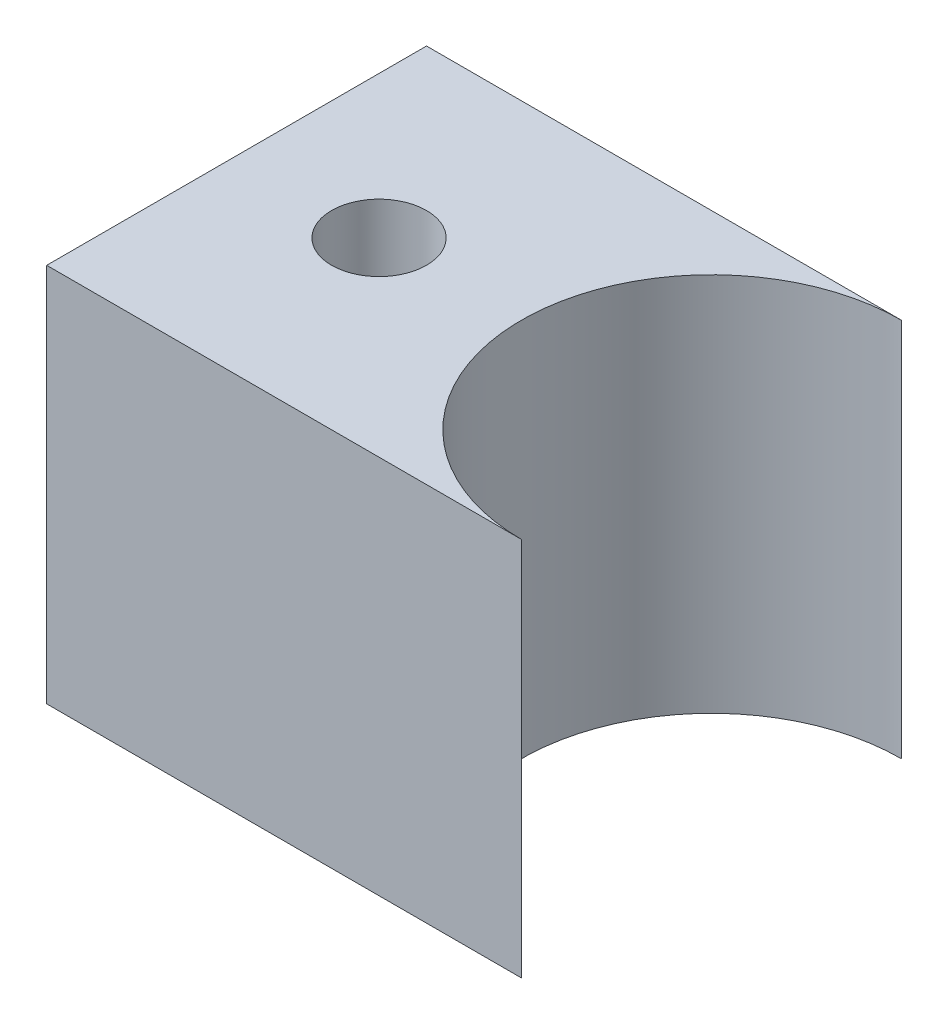
ISO-10303-21;
HEADER;
FILE_DESCRIPTION(('STEP AP214'),'2;1');
FILE_NAME('part.step','',(''),(''),'','','');
FILE_SCHEMA(('AUTOMOTIVE_DESIGN { 1 0 10303 214 1 1 1 1 }'));
ENDSEC;
DATA;
#1=APPLICATION_CONTEXT('core data for automotive mechanical design processes');
#2=APPLICATION_PROTOCOL_DEFINITION('international standard','automotive_design',2000,#1);
#3=PRODUCT_CONTEXT('',#1,'mechanical');
#4=PRODUCT('Part','Part','',(#3));
#5=PRODUCT_RELATED_PRODUCT_CATEGORY('part','',(#4));
#6=PRODUCT_DEFINITION_FORMATION('','',#4);
#7=PRODUCT_DEFINITION_CONTEXT('part definition',#1,'design');
#8=PRODUCT_DEFINITION('design','',#6,#7);
#9=PRODUCT_DEFINITION_SHAPE('','',#8);
#10=(LENGTH_UNIT() NAMED_UNIT(*) SI_UNIT(.MILLI.,.METRE.));
#11=(NAMED_UNIT(*) PLANE_ANGLE_UNIT() SI_UNIT($,.RADIAN.));
#12=(NAMED_UNIT(*) SI_UNIT($,.STERADIAN.) SOLID_ANGLE_UNIT());
#13=UNCERTAINTY_MEASURE_WITH_UNIT(LENGTH_MEASURE(1.E-05),#10,'distance_accuracy_value','');
#14=(GEOMETRIC_REPRESENTATION_CONTEXT(3) GLOBAL_UNCERTAINTY_ASSIGNED_CONTEXT((#13)) GLOBAL_UNIT_ASSIGNED_CONTEXT((#10,
#11,#12)) REPRESENTATION_CONTEXT('',''));
#15=CARTESIAN_POINT('',(0.,0.,0.));
#16=DIRECTION('',(0.,0.,1.));
#17=DIRECTION('',(1.,0.,0.));
#18=AXIS2_PLACEMENT_3D('',#15,#16,#17);
#19=CARTESIAN_POINT('',(-6.35,25.4,0.));
#20=DIRECTION('',(0.,-1.,0.));
#21=DIRECTION('',(0.,0.,-1.));
#22=AXIS2_PLACEMENT_3D('',#19,#20,#21);
#23=CYLINDRICAL_SURFACE('',#22,3.175);
#24=CARTESIAN_POINT('',(-6.35,16.2497579142809,-3.175));
#25=CARTESIAN_POINT('',(-6.42753031308926,16.2497496400657,-3.17500484576827));
#26=CARTESIAN_POINT('',(-6.50502629434486,16.2523079473555,-3.1721556587343));
#27=CARTESIAN_POINT('',(-6.65929000651205,16.2623750839429,-3.16084602870887));
#28=CARTESIAN_POINT('',(-6.73605761931208,16.2698847026793,-3.15238469091285));
#29=CARTESIAN_POINT('',(-6.96442289011765,16.2993888201432,-3.11877225231689));
#30=CARTESIAN_POINT('',(-7.11399762373616,16.3283579924054,-3.0853929885701));
#31=CARTESIAN_POINT('',(-7.40212661781048,16.399768221941,-2.99935785351024));
#32=CARTESIAN_POINT('',(-7.54077248347449,16.442077978454,-2.94688912119207));
#33=CARTESIAN_POINT('',(-7.80710374222936,16.5351493184864,-2.82470091022495));
#34=CARTESIAN_POINT('',(-7.93478685167322,16.5859126565251,-2.7549778490209));
#35=CARTESIAN_POINT('',(-8.19728822286527,16.6996413858596,-2.58766885557099));
#36=CARTESIAN_POINT('',(-8.33012347446768,16.7632761621358,-2.48743519963699));
#37=CARTESIAN_POINT('',(-8.57887057951206,16.890132586964,-2.26723292903927));
#38=CARTESIAN_POINT('',(-8.69476574887365,16.9533537704254,-2.14724510270102));
#39=CARTESIAN_POINT('',(-8.86195425151352,17.0483568223087,-1.94419368751008));
#40=CARTESIAN_POINT('',(-8.91969979024176,17.082035089254,-1.86724400494194));
#41=CARTESIAN_POINT('',(-9.028414283062,17.1466582642628,-1.70764042398512));
#42=CARTESIAN_POINT('',(-9.07938635617953,17.1776044281781,-1.62498917785726));
#43=CARTESIAN_POINT('',(-9.17396661882382,17.2358773773803,-1.45442160053206));
#44=CARTESIAN_POINT('',(-9.21757884139952,17.2632061431457,-1.36650818891102));
#45=CARTESIAN_POINT('',(-9.29683992359477,17.3134267129244,-1.18594835879345));
#46=CARTESIAN_POINT('',(-9.33249048897753,17.3363194672015,-1.09330295934871));
#47=CARTESIAN_POINT('',(-9.39168737104099,17.3746330315689,-0.914657611479679));
#48=CARTESIAN_POINT('',(-9.41614243894167,17.3906036897988,-0.829076462973849));
#49=CARTESIAN_POINT('',(-9.4578834845324,17.4179945641402,-0.655478654592643));
#50=CARTESIAN_POINT('',(-9.47517086623115,17.429415671402,-0.567462475298446));
#51=CARTESIAN_POINT('',(-9.50225014551956,17.4473527428168,-0.389870000382388));
#52=CARTESIAN_POINT('',(-9.51204941028754,17.4538735280429,-0.300295327079504));
#53=CARTESIAN_POINT('',(-9.52399644038159,17.4618293897958,-0.120445655332521));
#54=CARTESIAN_POINT('',(-9.52614528529924,17.4632651838927,-0.03017075750285));
#55=CARTESIAN_POINT('',(-9.52153058764431,17.4601842967821,0.212847482025028));
#56=CARTESIAN_POINT('',(-9.50754934882403,17.4508467119292,0.365477283401844));
#57=CARTESIAN_POINT('',(-9.45818598858135,17.4181851456931,0.665571061923041));
#58=CARTESIAN_POINT('',(-9.42280230640607,17.3948601442918,0.813034661497298));
#59=CARTESIAN_POINT('',(-9.3326003760419,17.3363255583869,1.09866580308969));
#60=CARTESIAN_POINT('',(-9.27785937303013,17.30116323696,1.2368677334448));
#61=CARTESIAN_POINT('',(-9.15105898860202,17.2215354096447,1.50210915896256));
#62=CARTESIAN_POINT('',(-9.07899644590943,17.1770682057561,1.62914661076028));
#63=CARTESIAN_POINT('',(-8.90908362709179,17.0754365573515,1.88640062998471));
#64=CARTESIAN_POINT('',(-8.80908902241075,17.0173714570948,2.01484129193776));
#65=CARTESIAN_POINT('',(-8.59171088064502,16.8973595865327,2.2542312534673));
#66=CARTESIAN_POINT('',(-8.47430052063018,16.8354069152307,2.36515301728573));
#67=CARTESIAN_POINT('',(-8.2042583924647,16.7028819527573,2.58400917496166));
#68=CARTESIAN_POINT('',(-8.04898840795544,16.6324648272995,2.688805774772));
#69=CARTESIAN_POINT('',(-7.71920313322987,16.5016753247811,2.87075365584123));
#70=CARTESIAN_POINT('',(-7.54472075954532,16.4412861987618,2.94795128728295));
#71=CARTESIAN_POINT('',(-7.23150848847472,16.3554230656605,3.0532819999139));
#72=CARTESIAN_POINT('',(-7.0967705249033,16.3249032875381,3.08912881829449));
#73=CARTESIAN_POINT('',(-6.82142481004695,16.2783685067922,3.1429254455291));
#74=CARTESIAN_POINT('',(-6.68082767980521,16.2623283589883,3.16090628575237));
#75=CARTESIAN_POINT('',(-6.3969217589822,16.2472299671058,3.17784797716998));
#76=CARTESIAN_POINT('',(-6.25360385906356,16.2482455999881,3.17672608475743));
#77=CARTESIAN_POINT('',(-5.96950191363213,16.2672693509993,3.15534087182034));
#78=CARTESIAN_POINT('',(-5.82872001633065,16.2852912431756,3.13506203530837));
#79=CARTESIAN_POINT('',(-5.56039429952431,16.3342316423522,3.07815950249654));
#80=CARTESIAN_POINT('',(-5.43253976157802,16.3644768430135,3.04238302035307));
#81=CARTESIAN_POINT('',(-5.18457459989573,16.4342755899854,2.95629078554842));
#82=CARTESIAN_POINT('',(-5.06446659344277,16.4738322615455,2.90597015007478));
#83=CARTESIAN_POINT('',(-4.80980431903229,16.5673323026917,2.78071812737818));
#84=CARTESIAN_POINT('',(-4.67716106171379,16.6225709179322,2.70287795751937));
#85=CARTESIAN_POINT('',(-4.42528832580718,16.7364174223926,2.52972461255558));
#86=CARTESIAN_POINT('',(-4.30607546716036,16.7950293534948,2.43439016364708));
#87=CARTESIAN_POINT('',(-4.05770977340867,16.9239513934039,2.20466694119547));
#88=CARTESIAN_POINT('',(-3.932074228409,16.9940200527151,2.06629613591577));
#89=CARTESIAN_POINT('',(-3.70551601582908,17.1255623617207,1.76704543824848));
#90=CARTESIAN_POINT('',(-3.60457151313051,17.1870435847794,1.60618563296259));
#91=CARTESIAN_POINT('',(-3.44822186446787,17.2845542872229,1.29776136627992));
#92=CARTESIAN_POINT('',(-3.38779404919719,17.3232041475117,1.15357650425641));
#93=CARTESIAN_POINT('',(-3.28833607902003,17.3875494873898,0.85527686294568));
#94=CARTESIAN_POINT('',(-3.24928785172457,17.4132559067226,0.70117059387859));
#95=CARTESIAN_POINT('',(-3.19453106989147,17.4494565289199,0.386348910278897));
#96=CARTESIAN_POINT('',(-3.17892639622874,17.4598830198291,0.225607303606698));
#97=CARTESIAN_POINT('',(-3.17238403592976,17.4642434088546,-0.0966081801862686));
#98=CARTESIAN_POINT('',(-3.1814440564727,17.4581788399738,-0.25808198784882));
#99=CARTESIAN_POINT('',(-3.2220844386066,17.4312192010763,-0.564765082925264));
#100=CARTESIAN_POINT('',(-3.25197943778886,17.4114345254766,-0.710303289757514));
#101=CARTESIAN_POINT('',(-3.33095284065091,17.359885686265,-0.993804246374777));
#102=CARTESIAN_POINT('',(-3.38003422439303,17.3281196617162,-1.13176581554505));
#103=CARTESIAN_POINT('',(-3.4987526913278,17.2528192761879,-1.40517133388982));
#104=CARTESIAN_POINT('',(-3.56941485289669,17.2087103235538,-1.54000769986339));
#105=CARTESIAN_POINT('',(-3.72768915860166,17.1128596092095,-1.79633985000039));
#106=CARTESIAN_POINT('',(-3.81531144498894,17.0611132847267,-1.917827583115));
#107=CARTESIAN_POINT('',(-4.02054833805973,16.9448627720992,-2.16422958614353));
#108=CARTESIAN_POINT('',(-4.14071262225813,16.8796320726258,-2.28667757230637));
#109=CARTESIAN_POINT('',(-4.39914292516088,16.7489721129079,-2.51079031886472));
#110=CARTESIAN_POINT('',(-4.53742235990132,16.6835427409576,-2.61243953137712));
#111=CARTESIAN_POINT('',(-4.81943918366087,16.5637241820613,-2.78627302038784));
#112=CARTESIAN_POINT('',(-4.96195415261561,16.5088735005282,-2.86011420444801));
#113=CARTESIAN_POINT('',(-5.25984127911376,16.4107423377871,-2.98633792804776));
#114=CARTESIAN_POINT('',(-5.41518774393146,16.3674394361282,-3.03876215630908));
#115=CARTESIAN_POINT('',(-5.7003432907101,16.3066557783442,-3.11048942328417));
#116=CARTESIAN_POINT('',(-5.82818035101134,16.2855788973276,-3.13455833161691));
#117=CARTESIAN_POINT('',(-6.08737974295221,16.2571426288587,-3.16680296090891));
#118=CARTESIAN_POINT('',(-6.21873907484623,16.2497719227519,-3.17499179598275));
#119=CARTESIAN_POINT('',(-6.35,16.2497579142809,-3.175));
#120=B_SPLINE_CURVE_WITH_KNOTS('',3,(#24,#25,#26,#27,#28,#29,#30,#31,#32,#33,#34,#35,#36,#37,
#38,#39,#40,#41,#42,#43,#44,#45,#46,#47,#48,#49,#50,#51,#52,#53,#54,#55,#56,#57,#58,#59,#60,#61,
#62,#63,#64,#65,#66,#67,#68,#69,#70,#71,#72,#73,#74,#75,#76,#77,#78,#79,#80,#81,#82,#83,#84,#85,
#86,#87,#88,#89,#90,#91,#92,#93,#94,#95,#96,#97,#98,#99,#100,#101,#102,#103,#104,#105,#106,#107,
#108,#109,#110,#111,#112,#113,#114,#115,#116,#117,#118,#119),.UNSPECIFIED.,.T.,.F.,(4,2,2,2,2,2,
2,2,2,2,2,2,2,2,2,2,2,2,2,2,2,2,2,2,2,2,2,2,2,2,2,2,2,2,2,2,2,2,2,2,2,2,2,2,2,2,2,4),(0.,
0.23243124625734,0.464899560397763,0.930088037462965,1.39083389168218,1.85167549198281,
2.38425030634412,2.917346163045,3.22278328993201,3.52807927902229,3.83320742500146,
4.1382701352628,4.40914536226321,4.6799675050406,4.95052285537199,5.2210400246797,
5.67924012217537,6.13747363750744,6.59389883732737,7.05040740058809,7.56690447915579,
8.0842054646496,8.68182442289395,9.27843496193814,9.70492668987399,10.1306763437413,
10.5582706022568,10.9862114839362,11.3932386756601,11.8004026749734,12.2889502819408,
12.7780959690837,13.37409312163,13.9695612926994,14.4506704720704,14.9313723344642,
15.4141980194601,15.8969788226923,16.3446564230742,16.7924035851585,17.2660585797609,
17.7399977027657,18.2884775296264,18.8373658802551,19.3443542518826,19.8503509991662,
20.2441887886898,20.6377011995485),.UNSPECIFIED.);
#121=CARTESIAN_POINT('',(-6.35,16.2497579142809,-3.175));
#122=VERTEX_POINT('',#121);
#123=EDGE_CURVE('E43',#122,#122,#120,.T.);
#124=ORIENTED_EDGE('',*,*,#123,.F.);
#125=EDGE_LOOP('',(#124));
#126=FACE_BOUND('',#125,.T.);
#127=CARTESIAN_POINT('',(-6.35,25.4,0.));
#128=DIRECTION('',(0.,1.,0.));
#129=DIRECTION('',(0.,0.,1.));
#130=AXIS2_PLACEMENT_3D('',#127,#128,#129);
#131=CIRCLE('',#130,3.175);
#132=CARTESIAN_POINT('',(-6.35,25.4,3.175));
#133=VERTEX_POINT('',#132);
#134=EDGE_CURVE('E121',#133,#133,#131,.T.);
#135=ORIENTED_EDGE('',*,*,#134,.T.);
#136=EDGE_LOOP('',(#135));
#137=FACE_BOUND('',#136,.T.);
#138=ADVANCED_FACE('F38',(#126,#137),#23,.F.);
#139=CARTESIAN_POINT('',(15.875,25.4,0.));
#140=DIRECTION('',(0.,-1.,0.));
#141=DIRECTION('',(0.,0.,-1.));
#142=AXIS2_PLACEMENT_3D('',#139,#140,#141);
#143=CYLINDRICAL_SURFACE('',#142,12.7);
#144=CARTESIAN_POINT('',(15.875,0.,0.));
#145=DIRECTION('',(0.,1.,0.));
#146=DIRECTION('',(0.,0.,1.));
#147=AXIS2_PLACEMENT_3D('',#144,#145,#146);
#148=CIRCLE('',#147,12.7);
#149=CARTESIAN_POINT('',(15.875,0.,-12.7));
#150=VERTEX_POINT('',#149);
#151=CARTESIAN_POINT('',(15.875,0.,12.7));
#152=VERTEX_POINT('',#151);
#153=EDGE_CURVE('E113',#150,#152,#148,.T.);
#154=ORIENTED_EDGE('',*,*,#153,.F.);
#155=DIRECTION('',(0.,-1.,0.));
#156=VECTOR('',#155,1.);
#157=CARTESIAN_POINT('',(15.875,25.4,-12.7));
#158=LINE('',#157,#156);
#159=CARTESIAN_POINT('',(15.875,25.4,-12.7));
#160=VERTEX_POINT('',#159);
#161=EDGE_CURVE('E11',#160,#150,#158,.T.);
#162=ORIENTED_EDGE('',*,*,#161,.F.);
#163=CARTESIAN_POINT('',(15.875,25.4,0.));
#164=DIRECTION('',(0.,1.,0.));
#165=DIRECTION('',(0.,0.,1.));
#166=AXIS2_PLACEMENT_3D('',#163,#164,#165);
#167=CIRCLE('',#166,12.7);
#168=CARTESIAN_POINT('',(15.875,25.4,12.7));
#169=VERTEX_POINT('',#168);
#170=EDGE_CURVE('E103',#160,#169,#167,.T.);
#171=ORIENTED_EDGE('',*,*,#170,.T.);
#172=DIRECTION('',(0.,-1.,0.));
#173=VECTOR('',#172,1.);
#174=CARTESIAN_POINT('',(15.875,25.4,12.7));
#175=LINE('',#174,#173);
#176=EDGE_CURVE('E84',#169,#152,#175,.T.);
#177=ORIENTED_EDGE('',*,*,#176,.T.);
#178=EDGE_LOOP('',(#154,#162,#171,#177));
#179=FACE_BOUND('',#178,.T.);
#180=ADVANCED_FACE('F151',(#179),#143,.F.);
#181=CARTESIAN_POINT('',(0.,25.4,-12.7));
#182=DIRECTION('',(0.,0.,-1.));
#183=DIRECTION('',(-1.,0.,0.));
#184=AXIS2_PLACEMENT_3D('',#181,#182,#183);
#185=PLANE('',#184);
#186=DIRECTION('',(1.,0.,0.));
#187=VECTOR('',#186,1.);
#188=CARTESIAN_POINT('',(0.,0.,-12.7));
#189=LINE('',#188,#187);
#190=CARTESIAN_POINT('',(-15.875,0.,-12.7));
#191=VERTEX_POINT('',#190);
#192=EDGE_CURVE('E95',#191,#150,#189,.T.);
#193=ORIENTED_EDGE('',*,*,#192,.F.);
#194=DIRECTION('',(0.,-1.,0.));
#195=VECTOR('',#194,1.);
#196=CARTESIAN_POINT('',(-15.875,25.4,-12.7));
#197=LINE('',#196,#195);
#198=CARTESIAN_POINT('',(-15.875,25.4,-12.7));
#199=VERTEX_POINT('',#198);
#200=EDGE_CURVE('E53',#199,#191,#197,.T.);
#201=ORIENTED_EDGE('',*,*,#200,.F.);
#202=DIRECTION('',(1.,0.,0.));
#203=VECTOR('',#202,1.);
#204=CARTESIAN_POINT('',(0.,25.4,-12.7));
#205=LINE('',#204,#203);
#206=EDGE_CURVE('E93',#199,#160,#205,.T.);
#207=ORIENTED_EDGE('',*,*,#206,.T.);
#208=ORIENTED_EDGE('',*,*,#161,.T.);
#209=EDGE_LOOP('',(#193,#201,#207,#208));
#210=FACE_BOUND('',#209,.T.);
#211=ADVANCED_FACE('F92',(#210),#185,.T.);
#212=CARTESIAN_POINT('',(-15.875,25.4,0.));
#213=DIRECTION('',(-1.,0.,0.));
#214=DIRECTION('',(0.,0.,1.));
#215=AXIS2_PLACEMENT_3D('',#212,#213,#214);
#216=PLANE('',#215);
#217=CARTESIAN_POINT('',(-15.875,12.7,0.));
#218=DIRECTION('',(-1.,0.,0.));
#219=DIRECTION('',(0.,0.,1.));
#220=AXIS2_PLACEMENT_3D('',#217,#218,#219);
#221=CIRCLE('',#220,4.7625);
#222=CARTESIAN_POINT('',(-15.875,12.7,4.7625));
#223=VERTEX_POINT('',#222);
#224=EDGE_CURVE('E161',#223,#223,#221,.T.);
#225=ORIENTED_EDGE('',*,*,#224,.F.);
#226=EDGE_LOOP('',(#225));
#227=FACE_BOUND('',#226,.T.);
#228=DIRECTION('',(0.,0.,-1.));
#229=VECTOR('',#228,1.);
#230=CARTESIAN_POINT('',(-15.875,0.,0.));
#231=LINE('',#230,#229);
#232=CARTESIAN_POINT('',(-15.875,0.,12.7));
#233=VERTEX_POINT('',#232);
#234=EDGE_CURVE('E117',#233,#191,#231,.T.);
#235=ORIENTED_EDGE('',*,*,#234,.F.);
#236=DIRECTION('',(0.,-1.,0.));
#237=VECTOR('',#236,1.);
#238=CARTESIAN_POINT('',(-15.875,25.4,12.7));
#239=LINE('',#238,#237);
#240=CARTESIAN_POINT('',(-15.875,25.4,12.7));
#241=VERTEX_POINT('',#240);
#242=EDGE_CURVE('E77',#241,#233,#239,.T.);
#243=ORIENTED_EDGE('',*,*,#242,.F.);
#244=DIRECTION('',(0.,0.,-1.));
#245=VECTOR('',#244,1.);
#246=CARTESIAN_POINT('',(-15.875,25.4,0.));
#247=LINE('',#246,#245);
#248=EDGE_CURVE('E102',#241,#199,#247,.T.);
#249=ORIENTED_EDGE('',*,*,#248,.T.);
#250=ORIENTED_EDGE('',*,*,#200,.T.);
#251=EDGE_LOOP('',(#235,#243,#249,#250));
#252=FACE_BOUND('',#251,.T.);
#253=ADVANCED_FACE('F105',(#227,#252),#216,.T.);
#254=CARTESIAN_POINT('',(-6.35,9.15024208571908,-3.175));
#255=CARTESIAN_POINT('',(-6.27246968691074,9.15025035993428,-3.17500484576827));
#256=CARTESIAN_POINT('',(-6.19497370565514,9.14769205264453,-3.1721556587343));
#257=CARTESIAN_POINT('',(-6.04070999348795,9.13762491605714,-3.16084602870887));
#258=CARTESIAN_POINT('',(-5.96394238068792,9.13011529732068,-3.15238469091285));
#259=CARTESIAN_POINT('',(-5.73557710988235,9.10061117985676,-3.11877225231689));
#260=CARTESIAN_POINT('',(-5.58600237626384,9.0716420075946,-3.0853929885701));
#261=CARTESIAN_POINT('',(-5.29787338218952,9.00023177805902,-2.99935785351024));
#262=CARTESIAN_POINT('',(-5.15922751652551,8.95792202154598,-2.94688912119207));
#263=CARTESIAN_POINT('',(-4.89289625777063,8.86485068151356,-2.82470091022495));
#264=CARTESIAN_POINT('',(-4.76521314832678,8.81408734347487,-2.7549778490209));
#265=CARTESIAN_POINT('',(-4.50271177713473,8.70035861414045,-2.58766885557099));
#266=CARTESIAN_POINT('',(-4.36987652553232,8.63672383786421,-2.48743519963699));
#267=CARTESIAN_POINT('',(-4.12112942048794,8.50986741303604,-2.26723292903927));
#268=CARTESIAN_POINT('',(-4.00523425112635,8.44664622957458,-2.14724510270102));
#269=CARTESIAN_POINT('',(-3.83804574848648,8.3516431776913,-1.94419368751008));
#270=CARTESIAN_POINT('',(-3.78030020975824,8.31796491074596,-1.86724400494194));
#271=CARTESIAN_POINT('',(-3.671585716938,8.25334173573725,-1.70764042398512));
#272=CARTESIAN_POINT('',(-3.62061364382047,8.22239557182186,-1.62498917785726));
#273=CARTESIAN_POINT('',(-3.52603338117618,8.16412262261973,-1.45442160053206));
#274=CARTESIAN_POINT('',(-3.48242115860048,8.1367938568543,-1.36650818891102));
#275=CARTESIAN_POINT('',(-3.40316007640523,8.08657328707563,-1.18594835879345));
#276=CARTESIAN_POINT('',(-3.36750951102247,8.06368053279845,-1.09330295934871));
#277=CARTESIAN_POINT('',(-3.30831262895901,8.02536696843111,-0.914657611479679));
#278=CARTESIAN_POINT('',(-3.28385756105833,8.00939631020124,-0.829076462973849));
#279=CARTESIAN_POINT('',(-3.2421165154676,7.98200543585981,-0.655478654592644));
#280=CARTESIAN_POINT('',(-3.22482913376885,7.97058432859796,-0.567462475298446));
#281=CARTESIAN_POINT('',(-3.19774985448044,7.95264725718324,-0.389870000382388));
#282=CARTESIAN_POINT('',(-3.18795058971246,7.94612647195707,-0.300295327079504));
#283=CARTESIAN_POINT('',(-3.17600355961841,7.93817061020416,-0.120445655332521));
#284=CARTESIAN_POINT('',(-3.17385471470076,7.93673481610732,-0.0301707575028504));
#285=CARTESIAN_POINT('',(-3.17846941235569,7.93981570321792,0.212847482025027));
#286=CARTESIAN_POINT('',(-3.19245065117597,7.94915328807079,0.365477283401844));
#287=CARTESIAN_POINT('',(-3.24181401141865,7.98181485430693,0.665571061923041));
#288=CARTESIAN_POINT('',(-3.27719769359393,8.00513985570821,0.813034661497298));
#289=CARTESIAN_POINT('',(-3.3673996239581,8.06367444161307,1.09866580308969));
#290=CARTESIAN_POINT('',(-3.42214062696987,8.09883676303997,1.2368677334448));
#291=CARTESIAN_POINT('',(-3.54894101139798,8.17846459035526,1.50210915896256));
#292=CARTESIAN_POINT('',(-3.62100355409057,8.22293179424386,1.62914661076028));
#293=CARTESIAN_POINT('',(-3.79091637290821,8.32456344264847,1.88640062998471));
#294=CARTESIAN_POINT('',(-3.89091097758925,8.3826285429052,2.01484129193776));
#295=CARTESIAN_POINT('',(-4.10828911935498,8.50264041346727,2.2542312534673));
#296=CARTESIAN_POINT('',(-4.22569947936982,8.5645930847693,2.36515301728574));
#297=CARTESIAN_POINT('',(-4.4957416075353,8.69711804724271,2.58400917496166));
#298=CARTESIAN_POINT('',(-4.65101159204456,8.76753517270049,2.688805774772));
#299=CARTESIAN_POINT('',(-4.98079686677013,8.89832467521888,2.87075365584123));
#300=CARTESIAN_POINT('',(-5.15527924045468,8.95871380123821,2.94795128728295));
#301=CARTESIAN_POINT('',(-5.46849151152528,9.04457693433952,3.0532819999139));
#302=CARTESIAN_POINT('',(-5.6032294750967,9.07509671246192,3.08912881829449));
#303=CARTESIAN_POINT('',(-5.87857518995304,9.12163149320775,3.1429254455291));
#304=CARTESIAN_POINT('',(-6.01917232019479,9.13767164101173,3.16090628575237));
#305=CARTESIAN_POINT('',(-6.30307824101779,9.15277003289416,3.17784797716998));
#306=CARTESIAN_POINT('',(-6.44639614093643,9.15175440001185,3.17672608475743));
#307=CARTESIAN_POINT('',(-6.73049808636786,9.1327306490007,3.15534087182034));
#308=CARTESIAN_POINT('',(-6.87127998366934,9.11470875682438,3.13506203530837));
#309=CARTESIAN_POINT('',(-7.13960570047568,9.06576835764784,3.07815950249654));
#310=CARTESIAN_POINT('',(-7.26746023842197,9.0355231569865,3.04238302035308));
#311=CARTESIAN_POINT('',(-7.51542540010426,8.96572441001461,2.95629078554843));
#312=CARTESIAN_POINT('',(-7.63553340655722,8.92616773845447,2.90597015007478));
#313=CARTESIAN_POINT('',(-7.8901956809677,8.83266769730834,2.78071812737818));
#314=CARTESIAN_POINT('',(-8.0228389382862,8.77742908206776,2.70287795751937));
#315=CARTESIAN_POINT('',(-8.27471167419282,8.66358257760736,2.52972461255559));
#316=CARTESIAN_POINT('',(-8.39392453283963,8.60497064650525,2.43439016364709));
#317=CARTESIAN_POINT('',(-8.64229022659132,8.47604860659614,2.20466694119548));
#318=CARTESIAN_POINT('',(-8.76792577159099,8.40597994728488,2.06629613591578));
#319=CARTESIAN_POINT('',(-8.99448398417091,8.27443763827926,1.76704543824849));
#320=CARTESIAN_POINT('',(-9.09542848686949,8.21295641522059,1.6061856329626));
#321=CARTESIAN_POINT('',(-9.25177813553213,8.11544571277712,1.29776136627993));
#322=CARTESIAN_POINT('',(-9.31220595080281,8.07679585248827,1.15357650425642));
#323=CARTESIAN_POINT('',(-9.41166392097997,8.0124505126102,0.855276862945691));
#324=CARTESIAN_POINT('',(-9.45071214827543,7.98674409327742,0.7011705938786));
#325=CARTESIAN_POINT('',(-9.50546893010853,7.95054347108012,0.386348910278906));
#326=CARTESIAN_POINT('',(-9.52107360377126,7.94011698017091,0.225607303606708));
#327=CARTESIAN_POINT('',(-9.52761596407024,7.93575659114538,-0.0966081801862597));
#328=CARTESIAN_POINT('',(-9.5185559435273,7.94182116002621,-0.258081987848811));
#329=CARTESIAN_POINT('',(-9.4779155613934,7.96878079892372,-0.564765082925257));
#330=CARTESIAN_POINT('',(-9.44802056221114,7.9885654745234,-0.710303289757507));
#331=CARTESIAN_POINT('',(-9.36904715934909,8.04011431373504,-0.99380424637477));
#332=CARTESIAN_POINT('',(-9.31996577560698,8.07188033828382,-1.13176581554504));
#333=CARTESIAN_POINT('',(-9.2012473086722,8.14718072381211,-1.40517133388981));
#334=CARTESIAN_POINT('',(-9.13058514710332,8.19128967644617,-1.54000769986338));
#335=CARTESIAN_POINT('',(-8.97231084139834,8.28714039079051,-1.79633985000038));
#336=CARTESIAN_POINT('',(-8.88468855501107,8.33888671527332,-1.917827583115));
#337=CARTESIAN_POINT('',(-8.67945166194027,8.45513722790084,-2.16422958614352));
#338=CARTESIAN_POINT('',(-8.55928737774187,8.52036792737423,-2.28667757230637));
#339=CARTESIAN_POINT('',(-8.30085707483912,8.65102788709211,-2.51079031886471));
#340=CARTESIAN_POINT('',(-8.16257764009868,8.71645725904239,-2.61243953137712));
#341=CARTESIAN_POINT('',(-7.88056081633914,8.83627581793871,-2.78627302038784));
#342=CARTESIAN_POINT('',(-7.7380458473844,8.89112649947175,-2.86011420444801));
#343=CARTESIAN_POINT('',(-7.44015872088625,8.98925766221291,-2.98633792804775));
#344=CARTESIAN_POINT('',(-7.28481225606855,9.03256056387175,-3.03876215630907));
#345=CARTESIAN_POINT('',(-6.99965670928991,9.09334422165577,-3.11048942328417));
#346=CARTESIAN_POINT('',(-6.87181964898866,9.11442110267243,-3.13455833161691));
#347=CARTESIAN_POINT('',(-6.6126202570478,9.14285737114135,-3.16680296090891));
#348=CARTESIAN_POINT('',(-6.48126092515377,9.1502280772481,-3.17499179598275));
#349=CARTESIAN_POINT('',(-6.35,9.15024208571908,-3.175));
#350=B_SPLINE_CURVE_WITH_KNOTS('',3,(#254,#255,#256,#257,#258,#259,#260,#261,#262,#263,#264,
#265,#266,#267,#268,#269,#270,#271,#272,#273,#274,#275,#276,#277,#278,#279,#280,#281,#282,#283,
#284,#285,#286,#287,#288,#289,#290,#291,#292,#293,#294,#295,#296,#297,#298,#299,#300,#301,#302,
#303,#304,#305,#306,#307,#308,#309,#310,#311,#312,#313,#314,#315,#316,#317,#318,#319,#320,#321,
#322,#323,#324,#325,#326,#327,#328,#329,#330,#331,#332,#333,#334,#335,#336,#337,#338,#339,#340,
#341,#342,#343,#344,#345,#346,#347,#348,#349),.UNSPECIFIED.,.T.,.F.,(4,2,2,2,2,2,2,2,2,2,2,2,2,
2,2,2,2,2,2,2,2,2,2,2,2,2,2,2,2,2,2,2,2,2,2,2,2,2,2,2,2,2,2,2,2,2,2,4),(0.,0.232431246257339,
0.464899560397761,0.930088037462964,1.39083389168218,1.85167549198281,2.38425030634412,
2.917346163045,3.22278328993201,3.52807927902229,3.83320742500145,4.1382701352628,
4.40914536226321,4.6799675050406,4.95052285537199,5.2210400246797,5.67924012217537,
6.13747363750744,6.59389883732737,7.05040740058809,7.5669044791558,8.0842054646496,
8.68182442289395,9.27843496193814,9.70492668987399,10.1306763437413,10.5582706022568,
10.9862114839362,11.3932386756601,11.8004026749734,12.2889502819408,12.7780959690837,
13.37409312163,13.9695612926994,14.4506704720704,14.9313723344642,15.4141980194601,
15.8969788226923,16.3446564230742,16.7924035851585,17.2660585797609,17.7399977027657,
18.2884775296264,18.837365880255,19.3443542518826,19.8503509991662,20.2441887886898,
20.6377011995485),.UNSPECIFIED.);
#351=CARTESIAN_POINT('',(-6.35,9.15024208571908,-3.175));
#352=VERTEX_POINT('',#351);
#353=EDGE_CURVE('E123',#352,#352,#350,.T.);
#354=ORIENTED_EDGE('',*,*,#353,.F.);
#355=EDGE_LOOP('',(#354));
#356=FACE_BOUND('',#355,.T.);
#357=CARTESIAN_POINT('',(-6.35,0.,0.));
#358=DIRECTION('',(0.,1.,0.));
#359=DIRECTION('',(0.,0.,1.));
#360=AXIS2_PLACEMENT_3D('',#357,#358,#359);
#361=CIRCLE('',#360,3.175);
#362=CARTESIAN_POINT('',(-6.35,0.,3.175));
#363=VERTEX_POINT('',#362);
#364=EDGE_CURVE('E110',#363,#363,#361,.T.);
#365=ORIENTED_EDGE('',*,*,#364,.F.);
#366=EDGE_LOOP('',(#365));
#367=FACE_BOUND('',#366,.T.);
#368=ADVANCED_FACE('F40',(#356,#367),#23,.F.);
#369=CARTESIAN_POINT('',(0.,25.4,12.7));
#370=DIRECTION('',(0.,0.,-1.));
#371=DIRECTION('',(-1.,0.,0.));
#372=AXIS2_PLACEMENT_3D('',#369,#370,#371);
#373=PLANE('',#372);
#374=DIRECTION('',(1.,0.,0.));
#375=VECTOR('',#374,1.);
#376=CARTESIAN_POINT('',(0.,0.,12.7));
#377=LINE('',#376,#375);
#378=EDGE_CURVE('E119',#233,#152,#377,.T.);
#379=ORIENTED_EDGE('',*,*,#378,.T.);
#380=ORIENTED_EDGE('',*,*,#176,.F.);
#381=DIRECTION('',(1.,0.,0.));
#382=VECTOR('',#381,1.);
#383=CARTESIAN_POINT('',(0.,25.4,12.7));
#384=LINE('',#383,#382);
#385=EDGE_CURVE('E62',#241,#169,#384,.T.);
#386=ORIENTED_EDGE('',*,*,#385,.F.);
#387=ORIENTED_EDGE('',*,*,#242,.T.);
#388=EDGE_LOOP('',(#379,#380,#386,#387));
#389=FACE_BOUND('',#388,.T.);
#390=ADVANCED_FACE('F140',(#389),#373,.F.);
#391=CARTESIAN_POINT('',(0.,25.4,0.));
#392=DIRECTION('',(0.,1.,0.));
#393=DIRECTION('',(0.,0.,1.));
#394=AXIS2_PLACEMENT_3D('',#391,#392,#393);
#395=PLANE('',#394);
#396=ORIENTED_EDGE('',*,*,#134,.F.);
#397=EDGE_LOOP('',(#396));
#398=FACE_BOUND('',#397,.T.);
#399=ORIENTED_EDGE('',*,*,#170,.F.);
#400=ORIENTED_EDGE('',*,*,#206,.F.);
#401=ORIENTED_EDGE('',*,*,#248,.F.);
#402=ORIENTED_EDGE('',*,*,#385,.T.);
#403=EDGE_LOOP('',(#399,#400,#401,#402));
#404=FACE_BOUND('',#403,.T.);
#405=ADVANCED_FACE('F101',(#398,#404),#395,.T.);
#406=CARTESIAN_POINT('',(0.,0.,0.));
#407=DIRECTION('',(0.,1.,0.));
#408=DIRECTION('',(0.,0.,1.));
#409=AXIS2_PLACEMENT_3D('',#406,#407,#408);
#410=PLANE('',#409);
#411=ORIENTED_EDGE('',*,*,#364,.T.);
#412=EDGE_LOOP('',(#411));
#413=FACE_BOUND('',#412,.T.);
#414=ORIENTED_EDGE('',*,*,#153,.T.);
#415=ORIENTED_EDGE('',*,*,#378,.F.);
#416=ORIENTED_EDGE('',*,*,#234,.T.);
#417=ORIENTED_EDGE('',*,*,#192,.T.);
#418=EDGE_LOOP('',(#414,#415,#416,#417));
#419=FACE_BOUND('',#418,.T.);
#420=ADVANCED_FACE('F135',(#413,#419),#410,.F.);
#421=CARTESIAN_POINT('',(-1.5875,12.7,0.));
#422=DIRECTION('',(-1.,0.,0.));
#423=DIRECTION('',(0.,0.,1.));
#424=AXIS2_PLACEMENT_3D('',#421,#422,#423);
#425=CYLINDRICAL_SURFACE('',#424,4.7625);
#426=ORIENTED_EDGE('',*,*,#123,.T.);
#427=EDGE_LOOP('',(#426));
#428=FACE_BOUND('',#427,.T.);
#429=ORIENTED_EDGE('',*,*,#353,.T.);
#430=EDGE_LOOP('',(#429));
#431=FACE_BOUND('',#430,.T.);
#432=CARTESIAN_POINT('',(-1.5875,12.7,0.));
#433=DIRECTION('',(-1.,0.,0.));
#434=DIRECTION('',(0.,0.,1.));
#435=AXIS2_PLACEMENT_3D('',#432,#433,#434);
#436=CIRCLE('',#435,4.7625);
#437=CARTESIAN_POINT('',(-1.5875,12.7,4.7625));
#438=VERTEX_POINT('',#437);
#439=EDGE_CURVE('E128',#438,#438,#436,.T.);
#440=ORIENTED_EDGE('',*,*,#439,.F.);
#441=EDGE_LOOP('',(#440));
#442=FACE_BOUND('',#441,.T.);
#443=ORIENTED_EDGE('',*,*,#224,.T.);
#444=EDGE_LOOP('',(#443));
#445=FACE_BOUND('',#444,.T.);
#446=ADVANCED_FACE('F129',(#428,#431,#442,#445),#425,.F.);
#447=CARTESIAN_POINT('',(-1.5875,12.7,0.));
#448=DIRECTION('',(-1.,0.,0.));
#449=DIRECTION('',(0.,0.,1.));
#450=AXIS2_PLACEMENT_3D('',#447,#448,#449);
#451=PLANE('',#450);
#452=ORIENTED_EDGE('',*,*,#439,.T.);
#453=EDGE_LOOP('',(#452));
#454=FACE_BOUND('',#453,.T.);
#455=ADVANCED_FACE('F134',(#454),#451,.T.);
#456=CLOSED_SHELL('',(#138,#180,#211,#253,#368,#390,#405,#420,#446,#455));
#457=MANIFOLD_SOLID_BREP('B2',#456);
#458=ADVANCED_BREP_SHAPE_REPRESENTATION('',(#18,#457),#14);
#459=SHAPE_DEFINITION_REPRESENTATION(#9,#458);
ENDSEC;
END-ISO-10303-21;
